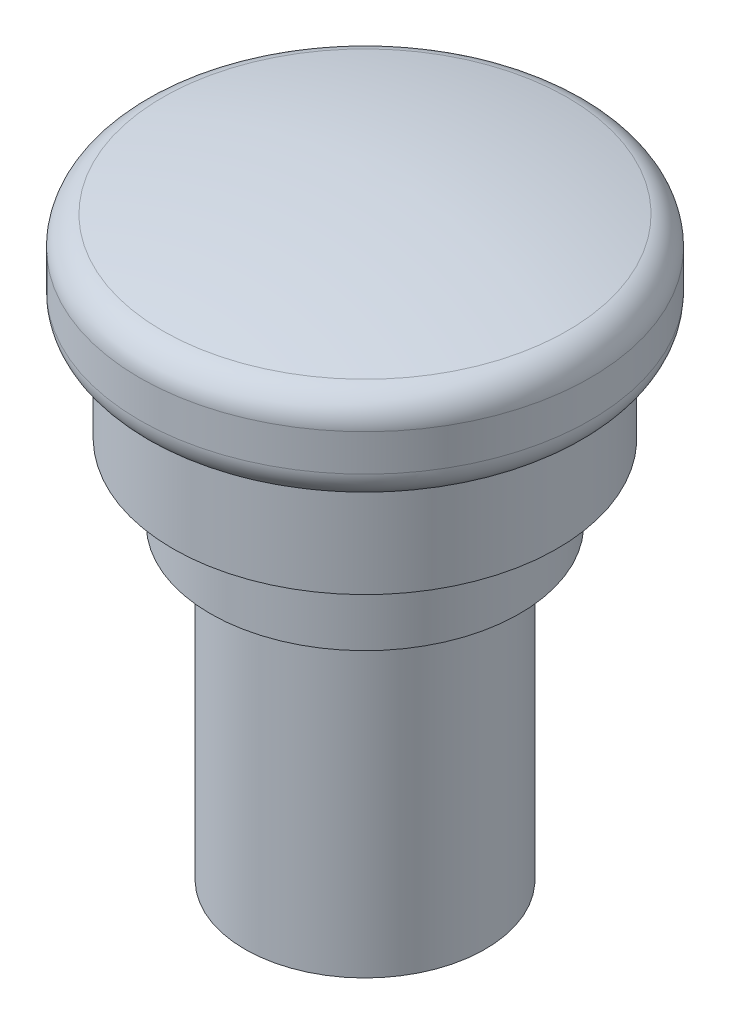
ISO-10303-21;
HEADER;
FILE_DESCRIPTION(('STEP AP214'),'2;1');
FILE_NAME('part.step','',(''),(''),'','','');
FILE_SCHEMA(('AUTOMOTIVE_DESIGN { 1 0 10303 214 1 1 1 1 }'));
ENDSEC;
DATA;
#1=APPLICATION_CONTEXT('core data for automotive mechanical design processes');
#2=APPLICATION_PROTOCOL_DEFINITION('international standard','automotive_design',2000,#1);
#3=PRODUCT_CONTEXT('',#1,'mechanical');
#4=PRODUCT('Part','Part','',(#3));
#5=PRODUCT_RELATED_PRODUCT_CATEGORY('part','',(#4));
#6=PRODUCT_DEFINITION_FORMATION('','',#4);
#7=PRODUCT_DEFINITION_CONTEXT('part definition',#1,'design');
#8=PRODUCT_DEFINITION('design','',#6,#7);
#9=PRODUCT_DEFINITION_SHAPE('','',#8);
#10=(LENGTH_UNIT() NAMED_UNIT(*) SI_UNIT(.MILLI.,.METRE.));
#11=(NAMED_UNIT(*) PLANE_ANGLE_UNIT() SI_UNIT($,.RADIAN.));
#12=(NAMED_UNIT(*) SI_UNIT($,.STERADIAN.) SOLID_ANGLE_UNIT());
#13=UNCERTAINTY_MEASURE_WITH_UNIT(LENGTH_MEASURE(1.E-05),#10,'distance_accuracy_value','');
#14=(GEOMETRIC_REPRESENTATION_CONTEXT(3) GLOBAL_UNCERTAINTY_ASSIGNED_CONTEXT((#13)) GLOBAL_UNIT_ASSIGNED_CONTEXT((#10,
#11,#12)) REPRESENTATION_CONTEXT('',''));
#15=CARTESIAN_POINT('',(0.,0.,0.));
#16=DIRECTION('',(0.,0.,1.));
#17=DIRECTION('',(1.,0.,0.));
#18=AXIS2_PLACEMENT_3D('',#15,#16,#17);
#19=CARTESIAN_POINT('',(0.,20.5,0.));
#20=DIRECTION('',(0.,-1.,0.));
#21=DIRECTION('',(0.,0.,-1.));
#22=AXIS2_PLACEMENT_3D('',#19,#20,#21);
#23=CYLINDRICAL_SURFACE('',#22,8.);
#24=CARTESIAN_POINT('',(0.,20.5,0.));
#25=DIRECTION('',(0.,1.,0.));
#26=DIRECTION('',(0.,0.,1.));
#27=AXIS2_PLACEMENT_3D('',#24,#25,#26);
#28=CIRCLE('',#27,8.);
#29=CARTESIAN_POINT('',(0.,20.5,8.));
#30=VERTEX_POINT('',#29);
#31=EDGE_CURVE('E53',#30,#30,#28,.T.);
#32=ORIENTED_EDGE('',*,*,#31,.F.);
#33=EDGE_LOOP('',(#32));
#34=FACE_BOUND('',#33,.T.);
#35=CARTESIAN_POINT('',(0.,0.,0.));
#36=DIRECTION('',(0.,1.,0.));
#37=DIRECTION('',(0.,0.,1.));
#38=AXIS2_PLACEMENT_3D('',#35,#36,#37);
#39=CIRCLE('',#38,8.);
#40=CARTESIAN_POINT('',(0.,0.,8.));
#41=VERTEX_POINT('',#40);
#42=EDGE_CURVE('E54',#41,#41,#39,.T.);
#43=ORIENTED_EDGE('',*,*,#42,.T.);
#44=EDGE_LOOP('',(#43));
#45=FACE_BOUND('',#44,.T.);
#46=ADVANCED_FACE('F33',(#34,#45),#23,.T.);
#47=CARTESIAN_POINT('',(0.,0.,0.));
#48=DIRECTION('',(0.,1.,0.));
#49=DIRECTION('',(0.,0.,1.));
#50=AXIS2_PLACEMENT_3D('',#47,#48,#49);
#51=PLANE('',#50);
#52=ORIENTED_EDGE('',*,*,#42,.F.);
#53=EDGE_LOOP('',(#52));
#54=FACE_BOUND('',#53,.T.);
#55=ADVANCED_FACE('F98',(#54),#51,.F.);
#56=CARTESIAN_POINT('',(0.,24.5,0.));
#57=DIRECTION('',(0.,-1.,0.));
#58=DIRECTION('',(0.,0.,-1.));
#59=AXIS2_PLACEMENT_3D('',#56,#57,#58);
#60=CYLINDRICAL_SURFACE('',#59,10.3);
#61=CARTESIAN_POINT('',(0.,24.5,0.));
#62=DIRECTION('',(0.,1.,0.));
#63=DIRECTION('',(0.,0.,1.));
#64=AXIS2_PLACEMENT_3D('',#61,#62,#63);
#65=CIRCLE('',#64,10.3);
#66=CARTESIAN_POINT('',(0.,24.5,10.3));
#67=VERTEX_POINT('',#66);
#68=EDGE_CURVE('E57',#67,#67,#65,.T.);
#69=ORIENTED_EDGE('',*,*,#68,.F.);
#70=EDGE_LOOP('',(#69));
#71=FACE_BOUND('',#70,.T.);
#72=CARTESIAN_POINT('',(0.,20.5,0.));
#73=DIRECTION('',(0.,1.,0.));
#74=DIRECTION('',(0.,0.,1.));
#75=AXIS2_PLACEMENT_3D('',#72,#73,#74);
#76=CIRCLE('',#75,10.3);
#77=CARTESIAN_POINT('',(0.,20.5,10.3));
#78=VERTEX_POINT('',#77);
#79=EDGE_CURVE('E60',#78,#78,#76,.T.);
#80=ORIENTED_EDGE('',*,*,#79,.T.);
#81=EDGE_LOOP('',(#80));
#82=FACE_BOUND('',#81,.T.);
#83=ADVANCED_FACE('F104',(#71,#82),#60,.T.);
#84=CARTESIAN_POINT('',(0.,20.5,0.));
#85=DIRECTION('',(0.,1.,0.));
#86=DIRECTION('',(0.,0.,1.));
#87=AXIS2_PLACEMENT_3D('',#84,#85,#86);
#88=PLANE('',#87);
#89=ORIENTED_EDGE('',*,*,#31,.T.);
#90=EDGE_LOOP('',(#89));
#91=FACE_BOUND('',#90,.T.);
#92=ORIENTED_EDGE('',*,*,#79,.F.);
#93=EDGE_LOOP('',(#92));
#94=FACE_BOUND('',#93,.T.);
#95=ADVANCED_FACE('F195',(#91,#94),#88,.F.);
#96=CARTESIAN_POINT('',(0.,25.5,0.));
#97=DIRECTION('',(0.,-1.,0.));
#98=DIRECTION('',(0.,0.,-1.));
#99=AXIS2_PLACEMENT_3D('',#96,#97,#98);
#100=CYLINDRICAL_SURFACE('',#99,10.9);
#101=CARTESIAN_POINT('',(0.,25.5,0.));
#102=DIRECTION('',(0.,1.,0.));
#103=DIRECTION('',(0.,0.,1.));
#104=AXIS2_PLACEMENT_3D('',#101,#102,#103);
#105=CIRCLE('',#104,10.9);
#106=CARTESIAN_POINT('',(0.,25.5,10.9));
#107=VERTEX_POINT('',#106);
#108=EDGE_CURVE('E63',#107,#107,#105,.T.);
#109=ORIENTED_EDGE('',*,*,#108,.F.);
#110=EDGE_LOOP('',(#109));
#111=FACE_BOUND('',#110,.T.);
#112=CARTESIAN_POINT('',(0.,24.5,0.));
#113=DIRECTION('',(0.,1.,0.));
#114=DIRECTION('',(0.,0.,1.));
#115=AXIS2_PLACEMENT_3D('',#112,#113,#114);
#116=CIRCLE('',#115,10.9);
#117=CARTESIAN_POINT('',(0.,24.5,10.9));
#118=VERTEX_POINT('',#117);
#119=EDGE_CURVE('E66',#118,#118,#116,.T.);
#120=ORIENTED_EDGE('',*,*,#119,.T.);
#121=EDGE_LOOP('',(#120));
#122=FACE_BOUND('',#121,.T.);
#123=ADVANCED_FACE('F185',(#111,#122),#100,.T.);
#124=CARTESIAN_POINT('',(0.,24.5,0.));
#125=DIRECTION('',(0.,1.,0.));
#126=DIRECTION('',(0.,0.,1.));
#127=AXIS2_PLACEMENT_3D('',#124,#125,#126);
#128=PLANE('',#127);
#129=ORIENTED_EDGE('',*,*,#68,.T.);
#130=EDGE_LOOP('',(#129));
#131=FACE_BOUND('',#130,.T.);
#132=ORIENTED_EDGE('',*,*,#119,.F.);
#133=EDGE_LOOP('',(#132));
#134=FACE_BOUND('',#133,.T.);
#135=ADVANCED_FACE('F84',(#131,#134),#128,.F.);
#136=CARTESIAN_POINT('',(0.,32.,0.));
#137=DIRECTION('',(0.,-1.,0.));
#138=DIRECTION('',(0.,0.,-1.));
#139=AXIS2_PLACEMENT_3D('',#136,#137,#138);
#140=CYLINDRICAL_SURFACE('',#139,12.8);
#141=CARTESIAN_POINT('',(0.,32.,0.));
#142=DIRECTION('',(0.,1.,0.));
#143=DIRECTION('',(0.,0.,1.));
#144=AXIS2_PLACEMENT_3D('',#141,#142,#143);
#145=CIRCLE('',#144,12.8);
#146=CARTESIAN_POINT('',(0.,32.,12.8));
#147=VERTEX_POINT('',#146);
#148=EDGE_CURVE('E69',#147,#147,#145,.T.);
#149=ORIENTED_EDGE('',*,*,#148,.F.);
#150=EDGE_LOOP('',(#149));
#151=FACE_BOUND('',#150,.T.);
#152=CARTESIAN_POINT('',(0.,25.5,0.));
#153=DIRECTION('',(0.,1.,0.));
#154=DIRECTION('',(0.,0.,1.));
#155=AXIS2_PLACEMENT_3D('',#152,#153,#154);
#156=CIRCLE('',#155,12.8);
#157=CARTESIAN_POINT('',(0.,25.5,12.8));
#158=VERTEX_POINT('',#157);
#159=EDGE_CURVE('E72',#158,#158,#156,.T.);
#160=ORIENTED_EDGE('',*,*,#159,.T.);
#161=EDGE_LOOP('',(#160));
#162=FACE_BOUND('',#161,.T.);
#163=ADVANCED_FACE('F80',(#151,#162),#140,.T.);
#164=CARTESIAN_POINT('',(0.,25.5,0.));
#165=DIRECTION('',(0.,1.,0.));
#166=DIRECTION('',(0.,0.,1.));
#167=AXIS2_PLACEMENT_3D('',#164,#165,#166);
#168=PLANE('',#167);
#169=ORIENTED_EDGE('',*,*,#108,.T.);
#170=EDGE_LOOP('',(#169));
#171=FACE_BOUND('',#170,.T.);
#172=ORIENTED_EDGE('',*,*,#159,.F.);
#173=EDGE_LOOP('',(#172));
#174=FACE_BOUND('',#173,.T.);
#175=ADVANCED_FACE('F83',(#171,#174),#168,.F.);
#176=CARTESIAN_POINT('',(0.,-17.2500000000002,0.));
#177=DIRECTION('',(0.,-1.,0.));
#178=DIRECTION('',(0.,0.,1.));
#179=AXIS2_PLACEMENT_3D('',#176,#177,#178);
#180=SPHERICAL_SURFACE('',#179,57.2500000000002);
#181=CARTESIAN_POINT('',(0.,38.3926612644935,0.));
#182=DIRECTION('',(0.,-1.,0.));
#183=DIRECTION('',(0.,0.,-1.));
#184=AXIS2_PLACEMENT_3D('',#181,#182,#183);
#185=CIRCLE('',#184,13.4705882352941);
#186=CARTESIAN_POINT('',(0.,38.3926612644935,-13.4705882352941));
#187=VERTEX_POINT('',#186);
#188=EDGE_CURVE('E10',#187,#187,#185,.F.);
#189=ORIENTED_EDGE('',*,*,#188,.T.);
#190=EDGE_LOOP('',(#189));
#191=FACE_BOUND('',#190,.T.);
#192=ADVANCED_FACE('F89',(#191),#180,.T.);
#193=CARTESIAN_POINT('',(0.,32.,0.));
#194=DIRECTION('',(0.,-1.,0.));
#195=DIRECTION('',(0.,0.,-1.));
#196=AXIS2_PLACEMENT_3D('',#193,#194,#195);
#197=CYLINDRICAL_SURFACE('',#196,15.);
#198=CARTESIAN_POINT('',(0.,34.,0.));
#199=DIRECTION('',(0.,1.,0.));
#200=DIRECTION('',(0.,0.,1.));
#201=AXIS2_PLACEMENT_3D('',#198,#199,#200);
#202=CIRCLE('',#201,15.);
#203=CARTESIAN_POINT('',(0.,34.,15.));
#204=VERTEX_POINT('',#203);
#205=EDGE_CURVE('E40',#204,#204,#202,.T.);
#206=ORIENTED_EDGE('',*,*,#205,.T.);
#207=EDGE_LOOP('',(#206));
#208=FACE_BOUND('',#207,.T.);
#209=CARTESIAN_POINT('',(0.,36.4488128360395,0.));
#210=DIRECTION('',(0.,-1.,0.));
#211=DIRECTION('',(0.,0.,-1.));
#212=AXIS2_PLACEMENT_3D('',#209,#210,#211);
#213=CIRCLE('',#212,15.);
#214=CARTESIAN_POINT('',(0.,36.4488128360395,-15.));
#215=VERTEX_POINT('',#214);
#216=EDGE_CURVE('E44',#215,#215,#213,.T.);
#217=ORIENTED_EDGE('',*,*,#216,.T.);
#218=EDGE_LOOP('',(#217));
#219=FACE_BOUND('',#218,.T.);
#220=ADVANCED_FACE('F95',(#208,#219),#197,.T.);
#221=CARTESIAN_POINT('',(0.,32.,12.8));
#222=DIRECTION('',(0.,1.,0.));
#223=DIRECTION('',(0.,0.,1.));
#224=AXIS2_PLACEMENT_3D('',#221,#222,#223);
#225=PLANE('',#224);
#226=CARTESIAN_POINT('',(0.,32.,0.));
#227=DIRECTION('',(0.,1.,0.));
#228=DIRECTION('',(0.,0.,1.));
#229=AXIS2_PLACEMENT_3D('',#226,#227,#228);
#230=CIRCLE('',#229,13.);
#231=CARTESIAN_POINT('',(0.,32.,13.));
#232=VERTEX_POINT('',#231);
#233=EDGE_CURVE('E48',#232,#232,#230,.F.);
#234=ORIENTED_EDGE('',*,*,#233,.T.);
#235=EDGE_LOOP('',(#234));
#236=FACE_BOUND('',#235,.T.);
#237=ORIENTED_EDGE('',*,*,#148,.T.);
#238=EDGE_LOOP('',(#237));
#239=FACE_BOUND('',#238,.T.);
#240=ADVANCED_FACE('F78',(#236,#239),#225,.F.);
#241=CARTESIAN_POINT('',(0.,34.,0.));
#242=DIRECTION('',(0.,1.,0.));
#243=DIRECTION('',(0.,0.,1.));
#244=AXIS2_PLACEMENT_3D('',#241,#242,#243);
#245=TOROIDAL_SURFACE('',#244,13.,2.);
#246=ORIENTED_EDGE('',*,*,#205,.F.);
#247=EDGE_LOOP('',(#246));
#248=FACE_BOUND('',#247,.T.);
#249=ORIENTED_EDGE('',*,*,#233,.F.);
#250=EDGE_LOOP('',(#249));
#251=FACE_BOUND('',#250,.T.);
#252=ADVANCED_FACE('F110',(#248,#251),#245,.T.);
#253=CARTESIAN_POINT('',(0.,36.4488128360395,0.));
#254=DIRECTION('',(0.,-1.,0.));
#255=DIRECTION('',(0.,0.,-1.));
#256=AXIS2_PLACEMENT_3D('',#253,#254,#255);
#257=TOROIDAL_SURFACE('',#256,13.,2.);
#258=ORIENTED_EDGE('',*,*,#188,.F.);
#259=EDGE_LOOP('',(#258));
#260=FACE_BOUND('',#259,.T.);
#261=ORIENTED_EDGE('',*,*,#216,.F.);
#262=EDGE_LOOP('',(#261));
#263=FACE_BOUND('',#262,.T.);
#264=ADVANCED_FACE('F35',(#260,#263),#257,.T.);
#265=CLOSED_SHELL('',(#46,#55,#83,#95,#123,#135,#163,#175,#192,#220,#240,#252,#264));
#266=MANIFOLD_SOLID_BREP('B2',#265);
#267=ADVANCED_BREP_SHAPE_REPRESENTATION('',(#18,#266),#14);
#268=SHAPE_DEFINITION_REPRESENTATION(#9,#267);
ENDSEC;
END-ISO-10303-21;
